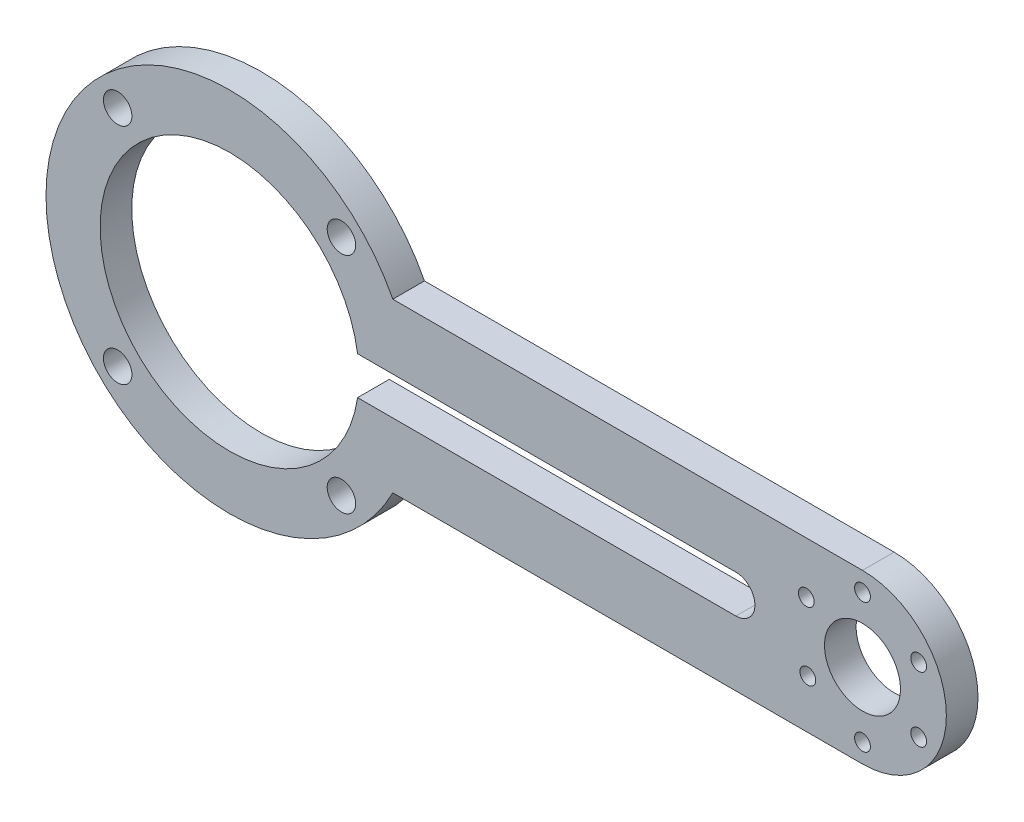
ISO-10303-21;
HEADER;
FILE_DESCRIPTION(('STEP AP214'),'2;1');
FILE_NAME('part.step','',(''),(''),'','','');
FILE_SCHEMA(('AUTOMOTIVE_DESIGN { 1 0 10303 214 1 1 1 1 }'));
ENDSEC;
DATA;
#1=APPLICATION_CONTEXT('core data for automotive mechanical design processes');
#2=APPLICATION_PROTOCOL_DEFINITION('international standard','automotive_design',2000,#1);
#3=PRODUCT_CONTEXT('',#1,'mechanical');
#4=PRODUCT('Part','Part','',(#3));
#5=PRODUCT_RELATED_PRODUCT_CATEGORY('part','',(#4));
#6=PRODUCT_DEFINITION_FORMATION('','',#4);
#7=PRODUCT_DEFINITION_CONTEXT('part definition',#1,'design');
#8=PRODUCT_DEFINITION('design','',#6,#7);
#9=PRODUCT_DEFINITION_SHAPE('','',#8);
#10=(LENGTH_UNIT() NAMED_UNIT(*) SI_UNIT(.MILLI.,.METRE.));
#11=(NAMED_UNIT(*) PLANE_ANGLE_UNIT() SI_UNIT($,.RADIAN.));
#12=(NAMED_UNIT(*) SI_UNIT($,.STERADIAN.) SOLID_ANGLE_UNIT());
#13=UNCERTAINTY_MEASURE_WITH_UNIT(LENGTH_MEASURE(1.E-05),#10,'distance_accuracy_value','');
#14=(GEOMETRIC_REPRESENTATION_CONTEXT(3) GLOBAL_UNCERTAINTY_ASSIGNED_CONTEXT((#13)) GLOBAL_UNIT_ASSIGNED_CONTEXT((#10,
#11,#12)) REPRESENTATION_CONTEXT('',''));
#15=CARTESIAN_POINT('',(0.,0.,0.));
#16=DIRECTION('',(0.,0.,1.));
#17=DIRECTION('',(1.,0.,0.));
#18=AXIS2_PLACEMENT_3D('',#15,#16,#17);
#19=CARTESIAN_POINT('',(0.,0.,5.));
#20=DIRECTION('',(0.,0.,-0.999999999999999));
#21=DIRECTION('',(-1.,0.,0.));
#22=AXIS2_PLACEMENT_3D('',#19,#20,#21);
#23=CYLINDRICAL_SURFACE('',#22,20.45);
#24=CARTESIAN_POINT('',(0.,0.,0.));
#25=DIRECTION('',(0.,0.,0.999999999999999));
#26=DIRECTION('',(1.,0.,0.));
#27=AXIS2_PLACEMENT_3D('',#24,#25,#26);
#28=CIRCLE('',#27,20.45);
#29=CARTESIAN_POINT('',(20.2287542869056,3.,0.));
#30=VERTEX_POINT('',#29);
#31=CARTESIAN_POINT('',(20.2287542869056,-3.,0.));
#32=VERTEX_POINT('',#31);
#33=EDGE_CURVE('E171',#30,#32,#28,.T.);
#34=ORIENTED_EDGE('',*,*,#33,.F.);
#35=DIRECTION('',(0.,0.,-0.999999999999999));
#36=VECTOR('',#35,1.);
#37=CARTESIAN_POINT('',(20.2287542869056,3.,5.));
#38=LINE('',#37,#36);
#39=CARTESIAN_POINT('',(20.2287542869056,3.,5.));
#40=VERTEX_POINT('',#39);
#41=EDGE_CURVE('E11',#40,#30,#38,.T.);
#42=ORIENTED_EDGE('',*,*,#41,.F.);
#43=CARTESIAN_POINT('',(0.,0.,5.));
#44=DIRECTION('',(0.,0.,0.999999999999999));
#45=DIRECTION('',(1.,0.,0.));
#46=AXIS2_PLACEMENT_3D('',#43,#44,#45);
#47=CIRCLE('',#46,20.45);
#48=CARTESIAN_POINT('',(20.2287542869056,-3.,5.));
#49=VERTEX_POINT('',#48);
#50=EDGE_CURVE('E130',#40,#49,#47,.T.);
#51=ORIENTED_EDGE('',*,*,#50,.T.);
#52=DIRECTION('',(0.,0.,-0.999999999999999));
#53=VECTOR('',#52,1.);
#54=CARTESIAN_POINT('',(20.2287542869056,-3.,5.));
#55=LINE('',#54,#53);
#56=EDGE_CURVE('E69',#49,#32,#55,.T.);
#57=ORIENTED_EDGE('',*,*,#56,.T.);
#58=EDGE_LOOP('',(#34,#42,#51,#57));
#59=FACE_BOUND('',#58,.T.);
#60=ADVANCED_FACE('F49',(#59),#23,.F.);
#61=CARTESIAN_POINT('',(0.,3.,4.99999999999998));
#62=DIRECTION('',(0.,1.,0.));
#63=DIRECTION('',(-1.,0.,0.));
#64=AXIS2_PLACEMENT_3D('',#61,#62,#63);
#65=PLANE('',#64);
#66=DIRECTION('',(1.,0.,0.));
#67=VECTOR('',#66,1.);
#68=CARTESIAN_POINT('',(0.,3.,0.));
#69=LINE('',#68,#67);
#70=CARTESIAN_POINT('',(80.,3.,0.));
#71=VERTEX_POINT('',#70);
#72=EDGE_CURVE('E137',#30,#71,#69,.T.);
#73=ORIENTED_EDGE('',*,*,#72,.T.);
#74=DIRECTION('',(0.,0.,-0.999999999999999));
#75=VECTOR('',#74,1.);
#76=CARTESIAN_POINT('',(80.,3.,4.99999999999999));
#77=LINE('',#76,#75);
#78=CARTESIAN_POINT('',(80.,3.,4.99999999999999));
#79=VERTEX_POINT('',#78);
#80=EDGE_CURVE('E60',#79,#71,#77,.T.);
#81=ORIENTED_EDGE('',*,*,#80,.F.);
#82=DIRECTION('',(1.,0.,0.));
#83=VECTOR('',#82,1.);
#84=CARTESIAN_POINT('',(0.,3.,4.99999999999998));
#85=LINE('',#84,#83);
#86=EDGE_CURVE('E123',#40,#79,#85,.T.);
#87=ORIENTED_EDGE('',*,*,#86,.F.);
#88=ORIENTED_EDGE('',*,*,#41,.T.);
#89=EDGE_LOOP('',(#73,#81,#87,#88));
#90=FACE_BOUND('',#89,.T.);
#91=ADVANCED_FACE('F135',(#90),#65,.F.);
#92=CARTESIAN_POINT('',(80.,0.,4.99999999999996));
#93=DIRECTION('',(0.,0.,-0.999999999999999));
#94=DIRECTION('',(-1.,0.,0.));
#95=AXIS2_PLACEMENT_3D('',#92,#93,#94);
#96=CYLINDRICAL_SURFACE('',#95,2.99999999999999);
#97=CARTESIAN_POINT('',(80.,0.,0.));
#98=DIRECTION('',(0.,0.,0.999999999999999));
#99=DIRECTION('',(1.,0.,0.));
#100=AXIS2_PLACEMENT_3D('',#97,#98,#99);
#101=CIRCLE('',#100,2.99999999999999);
#102=CARTESIAN_POINT('',(80.,-3.,0.));
#103=VERTEX_POINT('',#102);
#104=EDGE_CURVE('E176',#103,#71,#101,.T.);
#105=ORIENTED_EDGE('',*,*,#104,.F.);
#106=DIRECTION('',(0.,0.,-0.999999999999999));
#107=VECTOR('',#106,1.);
#108=CARTESIAN_POINT('',(80.,-3.,5.));
#109=LINE('',#108,#107);
#110=CARTESIAN_POINT('',(80.,-3.,5.));
#111=VERTEX_POINT('',#110);
#112=EDGE_CURVE('E94',#111,#103,#109,.T.);
#113=ORIENTED_EDGE('',*,*,#112,.F.);
#114=CARTESIAN_POINT('',(80.,0.,4.99999999999996));
#115=DIRECTION('',(0.,0.,0.999999999999999));
#116=DIRECTION('',(1.,0.,0.));
#117=AXIS2_PLACEMENT_3D('',#114,#115,#116);
#118=CIRCLE('',#117,2.99999999999999);
#119=EDGE_CURVE('E129',#111,#79,#118,.T.);
#120=ORIENTED_EDGE('',*,*,#119,.T.);
#121=ORIENTED_EDGE('',*,*,#80,.T.);
#122=EDGE_LOOP('',(#105,#113,#120,#121));
#123=FACE_BOUND('',#122,.T.);
#124=ADVANCED_FACE('F142',(#123),#96,.F.);
#125=CARTESIAN_POINT('',(0.,13.25,4.99999999999998));
#126=DIRECTION('',(0.,1.,0.));
#127=DIRECTION('',(0.,0.,0.999999999999999));
#128=AXIS2_PLACEMENT_3D('',#125,#126,#127);
#129=PLANE('',#128);
#130=DIRECTION('',(1.,0.,0.));
#131=VECTOR('',#130,1.);
#132=CARTESIAN_POINT('',(0.,13.2500000000001,0.));
#133=LINE('',#132,#131);
#134=CARTESIAN_POINT('',(25.7960752828797,13.25,0.));
#135=VERTEX_POINT('',#134);
#136=CARTESIAN_POINT('',(100.,13.25,0.));
#137=VERTEX_POINT('',#136);
#138=EDGE_CURVE('E156',#135,#137,#133,.T.);
#139=ORIENTED_EDGE('',*,*,#138,.F.);
#140=DIRECTION('',(0.,0.,-0.999999999999999));
#141=VECTOR('',#140,1.);
#142=CARTESIAN_POINT('',(25.7960752828798,13.25,5.));
#143=LINE('',#142,#141);
#144=CARTESIAN_POINT('',(25.7960752828798,13.25,5.));
#145=VERTEX_POINT('',#144);
#146=EDGE_CURVE('E53',#145,#135,#143,.T.);
#147=ORIENTED_EDGE('',*,*,#146,.F.);
#148=DIRECTION('',(1.,0.,0.));
#149=VECTOR('',#148,1.);
#150=CARTESIAN_POINT('',(0.,13.25,4.99999999999998));
#151=LINE('',#150,#149);
#152=CARTESIAN_POINT('',(99.9999999999999,13.2500000000001,4.99999999999999));
#153=VERTEX_POINT('',#152);
#154=EDGE_CURVE('E187',#145,#153,#151,.T.);
#155=ORIENTED_EDGE('',*,*,#154,.T.);
#156=DIRECTION('',(0.,0.,-0.999999999999999));
#157=VECTOR('',#156,1.);
#158=CARTESIAN_POINT('',(99.9999999999999,13.2500000000001,4.99999999999999));
#159=LINE('',#158,#157);
#160=EDGE_CURVE('E155',#153,#137,#159,.T.);
#161=ORIENTED_EDGE('',*,*,#160,.T.);
#162=EDGE_LOOP('',(#139,#147,#155,#161));
#163=FACE_BOUND('',#162,.T.);
#164=ADVANCED_FACE('F51',(#163),#129,.T.);
#165=CARTESIAN_POINT('',(0.,0.,5.));
#166=DIRECTION('',(0.,0.,-0.999999999999999));
#167=DIRECTION('',(-1.,0.,0.));
#168=AXIS2_PLACEMENT_3D('',#165,#166,#167);
#169=CYLINDRICAL_SURFACE('',#168,29.);
#170=CARTESIAN_POINT('',(0.,0.,0.));
#171=DIRECTION('',(0.,0.,0.999999999999999));
#172=DIRECTION('',(1.,0.,0.));
#173=AXIS2_PLACEMENT_3D('',#170,#171,#172);
#174=CIRCLE('',#173,29.);
#175=CARTESIAN_POINT('',(25.7960752828798,-13.2499999999999,0.));
#176=VERTEX_POINT('',#175);
#177=EDGE_CURVE('E160',#135,#176,#174,.T.);
#178=ORIENTED_EDGE('',*,*,#177,.T.);
#179=DIRECTION('',(0.,0.,-0.999999999999999));
#180=VECTOR('',#179,1.);
#181=CARTESIAN_POINT('',(25.7960752828798,-13.2499999999999,4.99999999999997));
#182=LINE('',#181,#180);
#183=CARTESIAN_POINT('',(25.7960752828798,-13.2499999999999,4.99999999999997));
#184=VERTEX_POINT('',#183);
#185=EDGE_CURVE('E197',#184,#176,#182,.T.);
#186=ORIENTED_EDGE('',*,*,#185,.F.);
#187=CARTESIAN_POINT('',(0.,0.,5.));
#188=DIRECTION('',(0.,0.,0.999999999999999));
#189=DIRECTION('',(1.,0.,0.));
#190=AXIS2_PLACEMENT_3D('',#187,#188,#189);
#191=CIRCLE('',#190,29.);
#192=EDGE_CURVE('E210',#145,#184,#191,.T.);
#193=ORIENTED_EDGE('',*,*,#192,.F.);
#194=ORIENTED_EDGE('',*,*,#146,.T.);
#195=EDGE_LOOP('',(#178,#186,#193,#194));
#196=FACE_BOUND('',#195,.T.);
#197=ADVANCED_FACE('F209',(#196),#169,.T.);
#198=CARTESIAN_POINT('',(0.,-13.25,4.99999999999996));
#199=DIRECTION('',(0.,1.,0.));
#200=DIRECTION('',(0.,0.,0.999999999999999));
#201=AXIS2_PLACEMENT_3D('',#198,#199,#200);
#202=PLANE('',#201);
#203=DIRECTION('',(1.,0.,0.));
#204=VECTOR('',#203,1.);
#205=CARTESIAN_POINT('',(0.,-13.25,0.));
#206=LINE('',#205,#204);
#207=CARTESIAN_POINT('',(100.,-13.25,0.));
#208=VERTEX_POINT('',#207);
#209=EDGE_CURVE('E164',#176,#208,#206,.T.);
#210=ORIENTED_EDGE('',*,*,#209,.T.);
#211=DIRECTION('',(0.,0.,-0.999999999999999));
#212=VECTOR('',#211,1.);
#213=CARTESIAN_POINT('',(100.,-13.25,4.99999999999999));
#214=LINE('',#213,#212);
#215=CARTESIAN_POINT('',(100.,-13.25,4.99999999999999));
#216=VERTEX_POINT('',#215);
#217=EDGE_CURVE('E194',#216,#208,#214,.T.);
#218=ORIENTED_EDGE('',*,*,#217,.F.);
#219=DIRECTION('',(1.,0.,0.));
#220=VECTOR('',#219,1.);
#221=CARTESIAN_POINT('',(0.,-13.25,4.99999999999996));
#222=LINE('',#221,#220);
#223=EDGE_CURVE('E223',#184,#216,#222,.T.);
#224=ORIENTED_EDGE('',*,*,#223,.F.);
#225=ORIENTED_EDGE('',*,*,#185,.T.);
#226=EDGE_LOOP('',(#210,#218,#224,#225));
#227=FACE_BOUND('',#226,.T.);
#228=ADVANCED_FACE('F222',(#227),#202,.F.);
#229=CARTESIAN_POINT('',(0.,-2.99999999999989,4.99999999999999));
#230=DIRECTION('',(0.,1.,0.));
#231=DIRECTION('',(0.,0.,0.999999999999999));
#232=AXIS2_PLACEMENT_3D('',#229,#230,#231);
#233=PLANE('',#232);
#234=DIRECTION('',(1.,0.,0.));
#235=VECTOR('',#234,1.);
#236=CARTESIAN_POINT('',(0.,-2.99999999999989,0.));
#237=LINE('',#236,#235);
#238=EDGE_CURVE('E179',#32,#103,#237,.T.);
#239=ORIENTED_EDGE('',*,*,#238,.F.);
#240=ORIENTED_EDGE('',*,*,#56,.F.);
#241=DIRECTION('',(1.,0.,0.));
#242=VECTOR('',#241,1.);
#243=CARTESIAN_POINT('',(0.,-2.99999999999989,4.99999999999999));
#244=LINE('',#243,#242);
#245=EDGE_CURVE('E144',#49,#111,#244,.T.);
#246=ORIENTED_EDGE('',*,*,#245,.T.);
#247=ORIENTED_EDGE('',*,*,#112,.T.);
#248=EDGE_LOOP('',(#239,#240,#246,#247));
#249=FACE_BOUND('',#248,.T.);
#250=ADVANCED_FACE('F235',(#249),#233,.T.);
#251=CARTESIAN_POINT('',(100.,0.,4.99999999999996));
#252=DIRECTION('',(0.,0.,-0.999999999999999));
#253=DIRECTION('',(-1.,0.,0.));
#254=AXIS2_PLACEMENT_3D('',#251,#252,#253);
#255=CYLINDRICAL_SURFACE('',#254,13.25);
#256=CARTESIAN_POINT('',(99.9999999999999,0.,0.));
#257=DIRECTION('',(0.,0.,0.999999999999999));
#258=DIRECTION('',(1.,0.,0.));
#259=AXIS2_PLACEMENT_3D('',#256,#257,#258);
#260=CIRCLE('',#259,13.25);
#261=EDGE_CURVE('E167',#208,#137,#260,.T.);
#262=ORIENTED_EDGE('',*,*,#261,.T.);
#263=ORIENTED_EDGE('',*,*,#160,.F.);
#264=CARTESIAN_POINT('',(100.,0.,4.99999999999996));
#265=DIRECTION('',(0.,0.,0.999999999999999));
#266=DIRECTION('',(1.,0.,0.));
#267=AXIS2_PLACEMENT_3D('',#264,#265,#266);
#268=CIRCLE('',#267,13.25);
#269=EDGE_CURVE('E221',#216,#153,#268,.T.);
#270=ORIENTED_EDGE('',*,*,#269,.F.);
#271=ORIENTED_EDGE('',*,*,#217,.T.);
#272=EDGE_LOOP('',(#262,#263,#270,#271));
#273=FACE_BOUND('',#272,.T.);
#274=ADVANCED_FACE('F219',(#273),#255,.T.);
#275=CARTESIAN_POINT('',(100.,0.,4.99999999999996));
#276=DIRECTION('',(0.,0.,-0.999999999999999));
#277=DIRECTION('',(-1.,0.,0.));
#278=AXIS2_PLACEMENT_3D('',#275,#276,#277);
#279=CYLINDRICAL_SURFACE('',#278,6.);
#280=CARTESIAN_POINT('',(100.,0.,4.99999999999996));
#281=DIRECTION('',(0.,0.,0.999999999999999));
#282=DIRECTION('',(1.,0.,0.));
#283=AXIS2_PLACEMENT_3D('',#280,#281,#282);
#284=CIRCLE('',#283,6.);
#285=CARTESIAN_POINT('',(106.,0.,4.99999999999996));
#286=VERTEX_POINT('',#285);
#287=EDGE_CURVE('E148',#286,#286,#284,.T.);
#288=ORIENTED_EDGE('',*,*,#287,.T.);
#289=EDGE_LOOP('',(#288));
#290=FACE_BOUND('',#289,.T.);
#291=CARTESIAN_POINT('',(99.9999999999999,0.,0.));
#292=DIRECTION('',(0.,0.,0.999999999999999));
#293=DIRECTION('',(1.,0.,0.));
#294=AXIS2_PLACEMENT_3D('',#291,#292,#293);
#295=CIRCLE('',#294,6.);
#296=CARTESIAN_POINT('',(106.,0.,0.));
#297=VERTEX_POINT('',#296);
#298=EDGE_CURVE('E183',#297,#297,#295,.T.);
#299=ORIENTED_EDGE('',*,*,#298,.F.);
#300=EDGE_LOOP('',(#299));
#301=FACE_BOUND('',#300,.T.);
#302=ADVANCED_FACE('F243',(#290,#301),#279,.F.);
#303=CARTESIAN_POINT('',(0.,0.,5.));
#304=DIRECTION('',(0.,0.,0.999999999999999));
#305=DIRECTION('',(1.,0.,0.));
#306=AXIS2_PLACEMENT_3D('',#303,#304,#305);
#307=PLANE('',#306);
#308=CARTESIAN_POINT('',(100.,10.2499999999999,4.99999999999995));
#309=DIRECTION('',(0.,0.,0.999999999999999));
#310=DIRECTION('',(1.,0.,0.));
#311=AXIS2_PLACEMENT_3D('',#308,#309,#310);
#312=CIRCLE('',#311,1.25);
#313=CARTESIAN_POINT('',(101.25,10.2499999999999,4.99999999999995));
#314=VERTEX_POINT('',#313);
#315=EDGE_CURVE('E394',#314,#314,#312,.T.);
#316=ORIENTED_EDGE('',*,*,#315,.F.);
#317=EDGE_LOOP('',(#316));
#318=FACE_BOUND('',#317,.T.);
#319=CARTESIAN_POINT('',(108.87676038879,5.1250000000001,4.99999999999996));
#320=DIRECTION('',(0.,0.,0.999999999999999));
#321=DIRECTION('',(1.,0.,0.));
#322=AXIS2_PLACEMENT_3D('',#319,#320,#321);
#323=CIRCLE('',#322,1.25);
#324=CARTESIAN_POINT('',(110.12676038879,5.1250000000001,4.99999999999996));
#325=VERTEX_POINT('',#324);
#326=EDGE_CURVE('E403',#325,#325,#323,.T.);
#327=ORIENTED_EDGE('',*,*,#326,.F.);
#328=EDGE_LOOP('',(#327));
#329=FACE_BOUND('',#328,.T.);
#330=CARTESIAN_POINT('',(108.87676038879,-5.12499999999999,4.99999999999994));
#331=DIRECTION('',(0.,0.,0.999999999999999));
#332=DIRECTION('',(1.,0.,0.));
#333=AXIS2_PLACEMENT_3D('',#330,#331,#332);
#334=CIRCLE('',#333,1.25);
#335=CARTESIAN_POINT('',(110.12676038879,-5.12499999999999,4.99999999999994));
#336=VERTEX_POINT('',#335);
#337=EDGE_CURVE('E416',#336,#336,#334,.T.);
#338=ORIENTED_EDGE('',*,*,#337,.F.);
#339=EDGE_LOOP('',(#338));
#340=FACE_BOUND('',#339,.T.);
#341=CARTESIAN_POINT('',(100.,-10.25,4.99999999999996));
#342=DIRECTION('',(0.,0.,0.999999999999999));
#343=DIRECTION('',(1.,0.,0.));
#344=AXIS2_PLACEMENT_3D('',#341,#342,#343);
#345=CIRCLE('',#344,1.25);
#346=CARTESIAN_POINT('',(101.25,-10.25,4.99999999999996));
#347=VERTEX_POINT('',#346);
#348=EDGE_CURVE('E424',#347,#347,#345,.T.);
#349=ORIENTED_EDGE('',*,*,#348,.F.);
#350=EDGE_LOOP('',(#349));
#351=FACE_BOUND('',#350,.T.);
#352=CARTESIAN_POINT('',(91.3623052319763,-5.51839914236507,4.99999999999999));
#353=DIRECTION('',(0.,0.,0.999999999999999));
#354=DIRECTION('',(1.,0.,0.));
#355=AXIS2_PLACEMENT_3D('',#352,#353,#354);
#356=CIRCLE('',#355,1.25);
#357=CARTESIAN_POINT('',(92.6123052319763,-5.51839914236507,4.99999999999999));
#358=VERTEX_POINT('',#357);
#359=EDGE_CURVE('E432',#358,#358,#356,.T.);
#360=ORIENTED_EDGE('',*,*,#359,.F.);
#361=EDGE_LOOP('',(#360));
#362=FACE_BOUND('',#361,.T.);
#363=CARTESIAN_POINT('',(17.6776695296637,17.6776695296638,4.99999999999997));
#364=DIRECTION('',(0.,0.,0.999999999999999));
#365=DIRECTION('',(1.,0.,0.));
#366=AXIS2_PLACEMENT_3D('',#363,#364,#365);
#367=CIRCLE('',#366,2.24999999999999);
#368=CARTESIAN_POINT('',(19.9276695296637,17.6776695296638,4.99999999999997));
#369=VERTEX_POINT('',#368);
#370=EDGE_CURVE('E440',#369,#369,#367,.T.);
#371=ORIENTED_EDGE('',*,*,#370,.F.);
#372=EDGE_LOOP('',(#371));
#373=FACE_BOUND('',#372,.T.);
#374=CARTESIAN_POINT('',(17.6776695296637,-17.6776695296636,5.));
#375=DIRECTION('',(0.,0.,0.999999999999999));
#376=DIRECTION('',(1.,0.,0.));
#377=AXIS2_PLACEMENT_3D('',#374,#375,#376);
#378=CIRCLE('',#377,2.25);
#379=CARTESIAN_POINT('',(19.9276695296637,-17.6776695296636,5.));
#380=VERTEX_POINT('',#379);
#381=EDGE_CURVE('E448',#380,#380,#378,.T.);
#382=ORIENTED_EDGE('',*,*,#381,.F.);
#383=EDGE_LOOP('',(#382));
#384=FACE_BOUND('',#383,.T.);
#385=CARTESIAN_POINT('',(-17.6776695296637,-17.6776695296637,5.));
#386=DIRECTION('',(0.,0.,0.999999999999999));
#387=DIRECTION('',(1.,0.,0.));
#388=AXIS2_PLACEMENT_3D('',#385,#386,#387);
#389=CIRCLE('',#388,2.25);
#390=CARTESIAN_POINT('',(-15.4276695296637,-17.6776695296637,5.));
#391=VERTEX_POINT('',#390);
#392=EDGE_CURVE('E456',#391,#391,#389,.T.);
#393=ORIENTED_EDGE('',*,*,#392,.F.);
#394=EDGE_LOOP('',(#393));
#395=FACE_BOUND('',#394,.T.);
#396=CARTESIAN_POINT('',(-17.6776695296637,17.6776695296637,4.99999999999999));
#397=DIRECTION('',(0.,0.,0.999999999999999));
#398=DIRECTION('',(1.,0.,0.));
#399=AXIS2_PLACEMENT_3D('',#396,#397,#398);
#400=CIRCLE('',#399,2.24999999999997);
#401=CARTESIAN_POINT('',(-15.4276695296637,17.6776695296637,4.99999999999999));
#402=VERTEX_POINT('',#401);
#403=EDGE_CURVE('E464',#402,#402,#400,.T.);
#404=ORIENTED_EDGE('',*,*,#403,.F.);
#405=EDGE_LOOP('',(#404));
#406=FACE_BOUND('',#405,.T.);
#407=CARTESIAN_POINT('',(91.1232396112095,5.12500000000005,4.99999999999998));
#408=DIRECTION('',(0.,0.,0.999999999999999));
#409=DIRECTION('',(1.,0.,0.));
#410=AXIS2_PLACEMENT_3D('',#407,#408,#409);
#411=CIRCLE('',#410,1.25);
#412=CARTESIAN_POINT('',(92.3732396112095,5.12500000000005,4.99999999999998));
#413=VERTEX_POINT('',#412);
#414=EDGE_CURVE('E396',#413,#413,#411,.T.);
#415=ORIENTED_EDGE('',*,*,#414,.F.);
#416=EDGE_LOOP('',(#415));
#417=FACE_BOUND('',#416,.T.);
#418=ORIENTED_EDGE('',*,*,#154,.F.);
#419=ORIENTED_EDGE('',*,*,#192,.T.);
#420=ORIENTED_EDGE('',*,*,#223,.T.);
#421=ORIENTED_EDGE('',*,*,#269,.T.);
#422=EDGE_LOOP('',(#418,#419,#420,#421));
#423=FACE_BOUND('',#422,.T.);
#424=ORIENTED_EDGE('',*,*,#50,.F.);
#425=ORIENTED_EDGE('',*,*,#86,.T.);
#426=ORIENTED_EDGE('',*,*,#119,.F.);
#427=ORIENTED_EDGE('',*,*,#245,.F.);
#428=EDGE_LOOP('',(#424,#425,#426,#427));
#429=FACE_BOUND('',#428,.T.);
#430=ORIENTED_EDGE('',*,*,#287,.F.);
#431=EDGE_LOOP('',(#430));
#432=FACE_BOUND('',#431,.T.);
#433=ADVANCED_FACE('F125',(#318,#329,#340,#351,#362,#373,#384,#395,#406,#417,#423,#429,#432),
#307,.T.);
#434=CARTESIAN_POINT('',(0.,0.,0.));
#435=DIRECTION('',(0.,0.,0.999999999999999));
#436=DIRECTION('',(1.,0.,0.));
#437=AXIS2_PLACEMENT_3D('',#434,#435,#436);
#438=PLANE('',#437);
#439=CARTESIAN_POINT('',(100.,10.25,0.));
#440=DIRECTION('',(0.,0.,0.999999999999999));
#441=DIRECTION('',(1.,0.,0.));
#442=AXIS2_PLACEMENT_3D('',#439,#440,#441);
#443=CIRCLE('',#442,1.25);
#444=CARTESIAN_POINT('',(101.25,10.25,0.));
#445=VERTEX_POINT('',#444);
#446=EDGE_CURVE('E391',#445,#445,#443,.T.);
#447=ORIENTED_EDGE('',*,*,#446,.T.);
#448=EDGE_LOOP('',(#447));
#449=FACE_BOUND('',#448,.T.);
#450=CARTESIAN_POINT('',(108.87676038879,5.12499999999999,0.));
#451=DIRECTION('',(0.,0.,0.999999999999999));
#452=DIRECTION('',(1.,0.,0.));
#453=AXIS2_PLACEMENT_3D('',#450,#451,#452);
#454=CIRCLE('',#453,1.25);
#455=CARTESIAN_POINT('',(110.12676038879,5.12499999999999,0.));
#456=VERTEX_POINT('',#455);
#457=EDGE_CURVE('E412',#456,#456,#454,.T.);
#458=ORIENTED_EDGE('',*,*,#457,.T.);
#459=EDGE_LOOP('',(#458));
#460=FACE_BOUND('',#459,.T.);
#461=CARTESIAN_POINT('',(108.87676038879,-5.12499999999999,0.));
#462=DIRECTION('',(0.,0.,0.999999999999999));
#463=DIRECTION('',(1.,0.,0.));
#464=AXIS2_PLACEMENT_3D('',#461,#462,#463);
#465=CIRCLE('',#464,1.25);
#466=CARTESIAN_POINT('',(110.12676038879,-5.12499999999999,0.));
#467=VERTEX_POINT('',#466);
#468=EDGE_CURVE('E420',#467,#467,#465,.T.);
#469=ORIENTED_EDGE('',*,*,#468,.T.);
#470=EDGE_LOOP('',(#469));
#471=FACE_BOUND('',#470,.T.);
#472=CARTESIAN_POINT('',(100.,-10.25,0.));
#473=DIRECTION('',(0.,0.,0.999999999999999));
#474=DIRECTION('',(1.,0.,0.));
#475=AXIS2_PLACEMENT_3D('',#472,#473,#474);
#476=CIRCLE('',#475,1.25);
#477=CARTESIAN_POINT('',(101.25,-10.25,0.));
#478=VERTEX_POINT('',#477);
#479=EDGE_CURVE('E428',#478,#478,#476,.T.);
#480=ORIENTED_EDGE('',*,*,#479,.T.);
#481=EDGE_LOOP('',(#480));
#482=FACE_BOUND('',#481,.T.);
#483=CARTESIAN_POINT('',(91.3623052319763,-5.51839914236507,0.));
#484=DIRECTION('',(0.,0.,0.999999999999999));
#485=DIRECTION('',(1.,0.,0.));
#486=AXIS2_PLACEMENT_3D('',#483,#484,#485);
#487=CIRCLE('',#486,1.25);
#488=CARTESIAN_POINT('',(92.6123052319763,-5.51839914236507,0.));
#489=VERTEX_POINT('',#488);
#490=EDGE_CURVE('E436',#489,#489,#487,.T.);
#491=ORIENTED_EDGE('',*,*,#490,.T.);
#492=EDGE_LOOP('',(#491));
#493=FACE_BOUND('',#492,.T.);
#494=CARTESIAN_POINT('',(17.6776695296637,17.6776695296637,0.));
#495=DIRECTION('',(0.,0.,0.999999999999999));
#496=DIRECTION('',(1.,0.,0.));
#497=AXIS2_PLACEMENT_3D('',#494,#495,#496);
#498=CIRCLE('',#497,2.24999999999999);
#499=CARTESIAN_POINT('',(19.9276695296637,17.6776695296637,0.));
#500=VERTEX_POINT('',#499);
#501=EDGE_CURVE('E444',#500,#500,#498,.T.);
#502=ORIENTED_EDGE('',*,*,#501,.T.);
#503=EDGE_LOOP('',(#502));
#504=FACE_BOUND('',#503,.T.);
#505=CARTESIAN_POINT('',(17.6776695296638,-17.6776695296635,0.));
#506=DIRECTION('',(0.,0.,0.999999999999999));
#507=DIRECTION('',(1.,0.,0.));
#508=AXIS2_PLACEMENT_3D('',#505,#506,#507);
#509=CIRCLE('',#508,2.25);
#510=CARTESIAN_POINT('',(19.9276695296638,-17.6776695296635,0.));
#511=VERTEX_POINT('',#510);
#512=EDGE_CURVE('E452',#511,#511,#509,.T.);
#513=ORIENTED_EDGE('',*,*,#512,.T.);
#514=EDGE_LOOP('',(#513));
#515=FACE_BOUND('',#514,.T.);
#516=CARTESIAN_POINT('',(-17.6776695296636,-17.6776695296637,0.));
#517=DIRECTION('',(0.,0.,0.999999999999999));
#518=DIRECTION('',(1.,0.,0.));
#519=AXIS2_PLACEMENT_3D('',#516,#517,#518);
#520=CIRCLE('',#519,2.25);
#521=CARTESIAN_POINT('',(-15.4276695296636,-17.6776695296637,0.));
#522=VERTEX_POINT('',#521);
#523=EDGE_CURVE('E460',#522,#522,#520,.T.);
#524=ORIENTED_EDGE('',*,*,#523,.T.);
#525=EDGE_LOOP('',(#524));
#526=FACE_BOUND('',#525,.T.);
#527=CARTESIAN_POINT('',(-17.6776695296637,17.6776695296637,0.));
#528=DIRECTION('',(0.,0.,0.999999999999999));
#529=DIRECTION('',(1.,0.,0.));
#530=AXIS2_PLACEMENT_3D('',#527,#528,#529);
#531=CIRCLE('',#530,2.24999999999997);
#532=CARTESIAN_POINT('',(-15.4276695296637,17.6776695296637,0.));
#533=VERTEX_POINT('',#532);
#534=EDGE_CURVE('E406',#533,#533,#531,.T.);
#535=ORIENTED_EDGE('',*,*,#534,.T.);
#536=EDGE_LOOP('',(#535));
#537=FACE_BOUND('',#536,.T.);
#538=CARTESIAN_POINT('',(91.1232396112095,5.12499999999999,0.));
#539=DIRECTION('',(0.,0.,0.999999999999999));
#540=DIRECTION('',(1.,0.,0.));
#541=AXIS2_PLACEMENT_3D('',#538,#539,#540);
#542=CIRCLE('',#541,1.25);
#543=CARTESIAN_POINT('',(92.3732396112095,5.12499999999999,0.));
#544=VERTEX_POINT('',#543);
#545=EDGE_CURVE('E161',#544,#544,#542,.T.);
#546=ORIENTED_EDGE('',*,*,#545,.T.);
#547=EDGE_LOOP('',(#546));
#548=FACE_BOUND('',#547,.T.);
#549=ORIENTED_EDGE('',*,*,#138,.T.);
#550=ORIENTED_EDGE('',*,*,#261,.F.);
#551=ORIENTED_EDGE('',*,*,#209,.F.);
#552=ORIENTED_EDGE('',*,*,#177,.F.);
#553=EDGE_LOOP('',(#549,#550,#551,#552));
#554=FACE_BOUND('',#553,.T.);
#555=ORIENTED_EDGE('',*,*,#33,.T.);
#556=ORIENTED_EDGE('',*,*,#238,.T.);
#557=ORIENTED_EDGE('',*,*,#104,.T.);
#558=ORIENTED_EDGE('',*,*,#72,.F.);
#559=EDGE_LOOP('',(#555,#556,#557,#558));
#560=FACE_BOUND('',#559,.T.);
#561=ORIENTED_EDGE('',*,*,#298,.T.);
#562=EDGE_LOOP('',(#561));
#563=FACE_BOUND('',#562,.T.);
#564=ADVANCED_FACE('F213',(#449,#460,#471,#482,#493,#504,#515,#526,#537,#548,#554,#560,#563),
#438,.F.);
#565=CARTESIAN_POINT('',(91.1232396112095,5.12499999999999,0.));
#566=DIRECTION('',(0.,0.,0.999999999999999));
#567=DIRECTION('',(1.,0.,0.));
#568=AXIS2_PLACEMENT_3D('',#565,#566,#567);
#569=CYLINDRICAL_SURFACE('',#568,1.25);
#570=ORIENTED_EDGE('',*,*,#545,.F.);
#571=EDGE_LOOP('',(#570));
#572=FACE_BOUND('',#571,.T.);
#573=ORIENTED_EDGE('',*,*,#414,.T.);
#574=EDGE_LOOP('',(#573));
#575=FACE_BOUND('',#574,.T.);
#576=ADVANCED_FACE('F304',(#572,#575),#569,.F.);
#577=CARTESIAN_POINT('',(-17.6776695296637,17.6776695296637,0.));
#578=DIRECTION('',(0.,0.,0.999999999999999));
#579=DIRECTION('',(1.,0.,0.));
#580=AXIS2_PLACEMENT_3D('',#577,#578,#579);
#581=CYLINDRICAL_SURFACE('',#580,2.24999999999997);
#582=ORIENTED_EDGE('',*,*,#534,.F.);
#583=EDGE_LOOP('',(#582));
#584=FACE_BOUND('',#583,.T.);
#585=ORIENTED_EDGE('',*,*,#403,.T.);
#586=EDGE_LOOP('',(#585));
#587=FACE_BOUND('',#586,.T.);
#588=ADVANCED_FACE('F313',(#584,#587),#581,.F.);
#589=CARTESIAN_POINT('',(-17.6776695296636,-17.6776695296637,0.));
#590=DIRECTION('',(0.,0.,0.999999999999999));
#591=DIRECTION('',(1.,0.,0.));
#592=AXIS2_PLACEMENT_3D('',#589,#590,#591);
#593=CYLINDRICAL_SURFACE('',#592,2.25);
#594=ORIENTED_EDGE('',*,*,#523,.F.);
#595=EDGE_LOOP('',(#594));
#596=FACE_BOUND('',#595,.T.);
#597=ORIENTED_EDGE('',*,*,#392,.T.);
#598=EDGE_LOOP('',(#597));
#599=FACE_BOUND('',#598,.T.);
#600=ADVANCED_FACE('F321',(#596,#599),#593,.F.);
#601=CARTESIAN_POINT('',(17.6776695296638,-17.6776695296635,0.));
#602=DIRECTION('',(0.,0.,0.999999999999999));
#603=DIRECTION('',(1.,0.,0.));
#604=AXIS2_PLACEMENT_3D('',#601,#602,#603);
#605=CYLINDRICAL_SURFACE('',#604,2.25);
#606=ORIENTED_EDGE('',*,*,#512,.F.);
#607=EDGE_LOOP('',(#606));
#608=FACE_BOUND('',#607,.T.);
#609=ORIENTED_EDGE('',*,*,#381,.T.);
#610=EDGE_LOOP('',(#609));
#611=FACE_BOUND('',#610,.T.);
#612=ADVANCED_FACE('F329',(#608,#611),#605,.F.);
#613=CARTESIAN_POINT('',(17.6776695296637,17.6776695296637,0.));
#614=DIRECTION('',(0.,0.,0.999999999999999));
#615=DIRECTION('',(1.,0.,0.));
#616=AXIS2_PLACEMENT_3D('',#613,#614,#615);
#617=CYLINDRICAL_SURFACE('',#616,2.24999999999999);
#618=ORIENTED_EDGE('',*,*,#501,.F.);
#619=EDGE_LOOP('',(#618));
#620=FACE_BOUND('',#619,.T.);
#621=ORIENTED_EDGE('',*,*,#370,.T.);
#622=EDGE_LOOP('',(#621));
#623=FACE_BOUND('',#622,.T.);
#624=ADVANCED_FACE('F337',(#620,#623),#617,.F.);
#625=CARTESIAN_POINT('',(91.3623052319763,-5.51839914236507,0.));
#626=DIRECTION('',(0.,0.,0.999999999999999));
#627=DIRECTION('',(1.,0.,0.));
#628=AXIS2_PLACEMENT_3D('',#625,#626,#627);
#629=CYLINDRICAL_SURFACE('',#628,1.25);
#630=ORIENTED_EDGE('',*,*,#490,.F.);
#631=EDGE_LOOP('',(#630));
#632=FACE_BOUND('',#631,.T.);
#633=ORIENTED_EDGE('',*,*,#359,.T.);
#634=EDGE_LOOP('',(#633));
#635=FACE_BOUND('',#634,.T.);
#636=ADVANCED_FACE('F345',(#632,#635),#629,.F.);
#637=CARTESIAN_POINT('',(100.,-10.25,0.));
#638=DIRECTION('',(0.,0.,0.999999999999999));
#639=DIRECTION('',(1.,0.,0.));
#640=AXIS2_PLACEMENT_3D('',#637,#638,#639);
#641=CYLINDRICAL_SURFACE('',#640,1.25);
#642=ORIENTED_EDGE('',*,*,#479,.F.);
#643=EDGE_LOOP('',(#642));
#644=FACE_BOUND('',#643,.T.);
#645=ORIENTED_EDGE('',*,*,#348,.T.);
#646=EDGE_LOOP('',(#645));
#647=FACE_BOUND('',#646,.T.);
#648=ADVANCED_FACE('F353',(#644,#647),#641,.F.);
#649=CARTESIAN_POINT('',(108.87676038879,-5.12499999999999,0.));
#650=DIRECTION('',(0.,0.,0.999999999999999));
#651=DIRECTION('',(1.,0.,0.));
#652=AXIS2_PLACEMENT_3D('',#649,#650,#651);
#653=CYLINDRICAL_SURFACE('',#652,1.25);
#654=ORIENTED_EDGE('',*,*,#468,.F.);
#655=EDGE_LOOP('',(#654));
#656=FACE_BOUND('',#655,.T.);
#657=ORIENTED_EDGE('',*,*,#337,.T.);
#658=EDGE_LOOP('',(#657));
#659=FACE_BOUND('',#658,.T.);
#660=ADVANCED_FACE('F361',(#656,#659),#653,.F.);
#661=CARTESIAN_POINT('',(108.87676038879,5.12499999999999,0.));
#662=DIRECTION('',(0.,0.,0.999999999999999));
#663=DIRECTION('',(1.,0.,0.));
#664=AXIS2_PLACEMENT_3D('',#661,#662,#663);
#665=CYLINDRICAL_SURFACE('',#664,1.25);
#666=ORIENTED_EDGE('',*,*,#457,.F.);
#667=EDGE_LOOP('',(#666));
#668=FACE_BOUND('',#667,.T.);
#669=ORIENTED_EDGE('',*,*,#326,.T.);
#670=EDGE_LOOP('',(#669));
#671=FACE_BOUND('',#670,.T.);
#672=ADVANCED_FACE('F369',(#668,#671),#665,.F.);
#673=CARTESIAN_POINT('',(100.,10.25,0.));
#674=DIRECTION('',(0.,0.,0.999999999999999));
#675=DIRECTION('',(1.,0.,0.));
#676=AXIS2_PLACEMENT_3D('',#673,#674,#675);
#677=CYLINDRICAL_SURFACE('',#676,1.25);
#678=ORIENTED_EDGE('',*,*,#446,.F.);
#679=EDGE_LOOP('',(#678));
#680=FACE_BOUND('',#679,.T.);
#681=ORIENTED_EDGE('',*,*,#315,.T.);
#682=EDGE_LOOP('',(#681));
#683=FACE_BOUND('',#682,.T.);
#684=ADVANCED_FACE('F377',(#680,#683),#677,.F.);
#685=CLOSED_SHELL('',(#60,#91,#124,#164,#197,#228,#250,#274,#302,#433,#564,#576,#588,#600,#612,
#624,#636,#648,#660,#672,#684));
#686=MANIFOLD_SOLID_BREP('B2',#685);
#687=ADVANCED_BREP_SHAPE_REPRESENTATION('',(#18,#686),#14);
#688=SHAPE_DEFINITION_REPRESENTATION(#9,#687);
ENDSEC;
END-ISO-10303-21;
